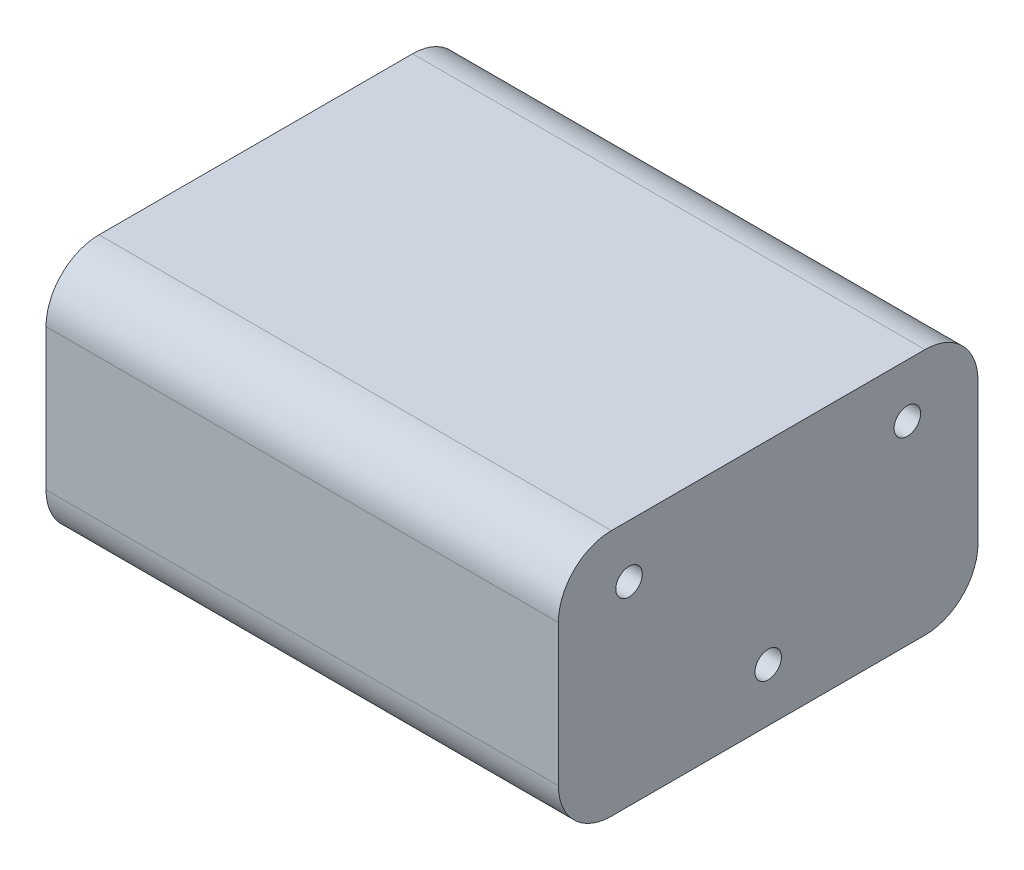
ISO-10303-21;
HEADER;
FILE_DESCRIPTION(('STEP AP214'),'2;1');
FILE_NAME('part.step','',(''),(''),'','','');
FILE_SCHEMA(('AUTOMOTIVE_DESIGN { 1 0 10303 214 1 1 1 1 }'));
ENDSEC;
DATA;
#1=APPLICATION_CONTEXT('core data for automotive mechanical design processes');
#2=APPLICATION_PROTOCOL_DEFINITION('international standard','automotive_design',2000,#1);
#3=PRODUCT_CONTEXT('',#1,'mechanical');
#4=PRODUCT('Part','Part','',(#3));
#5=PRODUCT_RELATED_PRODUCT_CATEGORY('part','',(#4));
#6=PRODUCT_DEFINITION_FORMATION('','',#4);
#7=PRODUCT_DEFINITION_CONTEXT('part definition',#1,'design');
#8=PRODUCT_DEFINITION('design','',#6,#7);
#9=PRODUCT_DEFINITION_SHAPE('','',#8);
#10=(LENGTH_UNIT() NAMED_UNIT(*) SI_UNIT(.MILLI.,.METRE.));
#11=(NAMED_UNIT(*) PLANE_ANGLE_UNIT() SI_UNIT($,.RADIAN.));
#12=(NAMED_UNIT(*) SI_UNIT($,.STERADIAN.) SOLID_ANGLE_UNIT());
#13=UNCERTAINTY_MEASURE_WITH_UNIT(LENGTH_MEASURE(1.E-05),#10,'distance_accuracy_value','');
#14=(GEOMETRIC_REPRESENTATION_CONTEXT(3) GLOBAL_UNCERTAINTY_ASSIGNED_CONTEXT((#13)) GLOBAL_UNIT_ASSIGNED_CONTEXT((#10,
#11,#12)) REPRESENTATION_CONTEXT('',''));
#15=CARTESIAN_POINT('',(0.,0.,0.));
#16=DIRECTION('',(0.,0.,1.));
#17=DIRECTION('',(1.,0.,0.));
#18=AXIS2_PLACEMENT_3D('',#15,#16,#17);
#19=CARTESIAN_POINT('',(29.,28.,23.75));
#20=DIRECTION('',(-1.,0.,0.));
#21=DIRECTION('',(0.,0.,1.));
#22=AXIS2_PLACEMENT_3D('',#19,#20,#21);
#23=PLANE('',#22);
#24=CARTESIAN_POINT('',(29.,6.,0.));
#25=DIRECTION('',(-1.,0.,0.));
#26=DIRECTION('',(0.,0.,1.));
#27=AXIS2_PLACEMENT_3D('',#24,#25,#26);
#28=CIRCLE('',#27,1.5);
#29=CARTESIAN_POINT('',(29.,6.,1.5));
#30=VERTEX_POINT('',#29);
#31=EDGE_CURVE('E511',#30,#30,#28,.T.);
#32=ORIENTED_EDGE('',*,*,#31,.T.);
#33=EDGE_LOOP('',(#32));
#34=FACE_BOUND('',#33,.T.);
#35=CARTESIAN_POINT('',(29.,22.,15.75));
#36=DIRECTION('',(-1.,0.,0.));
#37=DIRECTION('',(0.,0.,1.));
#38=AXIS2_PLACEMENT_3D('',#35,#36,#37);
#39=CIRCLE('',#38,1.5);
#40=CARTESIAN_POINT('',(29.,22.,17.25));
#41=VERTEX_POINT('',#40);
#42=EDGE_CURVE('E514',#41,#41,#39,.T.);
#43=ORIENTED_EDGE('',*,*,#42,.T.);
#44=EDGE_LOOP('',(#43));
#45=FACE_BOUND('',#44,.T.);
#46=CARTESIAN_POINT('',(29.,22.,-15.75));
#47=DIRECTION('',(-1.,0.,0.));
#48=DIRECTION('',(0.,0.,1.));
#49=AXIS2_PLACEMENT_3D('',#46,#47,#48);
#50=CIRCLE('',#49,1.5);
#51=CARTESIAN_POINT('',(29.,22.,-14.25));
#52=VERTEX_POINT('',#51);
#53=EDGE_CURVE('E488',#52,#52,#50,.T.);
#54=ORIENTED_EDGE('',*,*,#53,.T.);
#55=EDGE_LOOP('',(#54));
#56=FACE_BOUND('',#55,.T.);
#57=DIRECTION('',(0.,0.,-1.));
#58=VECTOR('',#57,1.);
#59=CARTESIAN_POINT('',(29.,0.,23.75));
#60=LINE('',#59,#58);
#61=CARTESIAN_POINT('',(29.,0.,17.75));
#62=VERTEX_POINT('',#61);
#63=CARTESIAN_POINT('',(29.,0.,-17.75));
#64=VERTEX_POINT('',#63);
#65=EDGE_CURVE('E204',#62,#64,#60,.T.);
#66=ORIENTED_EDGE('',*,*,#65,.T.);
#67=CARTESIAN_POINT('',(29.,6.,-17.75));
#68=DIRECTION('',(-1.,0.,0.));
#69=DIRECTION('',(0.,0.,1.));
#70=AXIS2_PLACEMENT_3D('',#67,#68,#69);
#71=CIRCLE('',#70,6.);
#72=CARTESIAN_POINT('',(29.,6.,-23.75));
#73=VERTEX_POINT('',#72);
#74=EDGE_CURVE('E176',#64,#73,#71,.F.);
#75=ORIENTED_EDGE('',*,*,#74,.T.);
#76=DIRECTION('',(0.,-1.,0.));
#77=VECTOR('',#76,1.);
#78=CARTESIAN_POINT('',(29.,28.,-23.75));
#79=LINE('',#78,#77);
#80=CARTESIAN_POINT('',(29.,22.,-23.75));
#81=VERTEX_POINT('',#80);
#82=EDGE_CURVE('E143',#81,#73,#79,.T.);
#83=ORIENTED_EDGE('',*,*,#82,.F.);
#84=CARTESIAN_POINT('',(29.,22.,-17.75));
#85=DIRECTION('',(-1.,0.,0.));
#86=DIRECTION('',(0.,0.,1.));
#87=AXIS2_PLACEMENT_3D('',#84,#85,#86);
#88=CIRCLE('',#87,6.);
#89=CARTESIAN_POINT('',(29.,28.,-17.75));
#90=VERTEX_POINT('',#89);
#91=EDGE_CURVE('E148',#81,#90,#88,.F.);
#92=ORIENTED_EDGE('',*,*,#91,.T.);
#93=DIRECTION('',(0.,0.,-1.));
#94=VECTOR('',#93,1.);
#95=CARTESIAN_POINT('',(29.,28.,23.75));
#96=LINE('',#95,#94);
#97=CARTESIAN_POINT('',(29.,28.,17.75));
#98=VERTEX_POINT('',#97);
#99=EDGE_CURVE('E191',#98,#90,#96,.T.);
#100=ORIENTED_EDGE('',*,*,#99,.F.);
#101=CARTESIAN_POINT('',(29.,22.,17.75));
#102=DIRECTION('',(-1.,0.,0.));
#103=DIRECTION('',(0.,0.,1.));
#104=AXIS2_PLACEMENT_3D('',#101,#102,#103);
#105=CIRCLE('',#104,6.);
#106=CARTESIAN_POINT('',(29.,22.,23.75));
#107=VERTEX_POINT('',#106);
#108=EDGE_CURVE('E77',#98,#107,#105,.F.);
#109=ORIENTED_EDGE('',*,*,#108,.T.);
#110=DIRECTION('',(0.,-1.,0.));
#111=VECTOR('',#110,1.);
#112=CARTESIAN_POINT('',(29.,28.,23.75));
#113=LINE('',#112,#111);
#114=CARTESIAN_POINT('',(29.,6.,23.75));
#115=VERTEX_POINT('',#114);
#116=EDGE_CURVE('E201',#107,#115,#113,.T.);
#117=ORIENTED_EDGE('',*,*,#116,.T.);
#118=CARTESIAN_POINT('',(29.,6.,17.75));
#119=DIRECTION('',(-1.,0.,0.));
#120=DIRECTION('',(0.,0.,1.));
#121=AXIS2_PLACEMENT_3D('',#118,#119,#120);
#122=CIRCLE('',#121,6.);
#123=EDGE_CURVE('E69',#115,#62,#122,.F.);
#124=ORIENTED_EDGE('',*,*,#123,.T.);
#125=EDGE_LOOP('',(#66,#75,#83,#92,#100,#109,#117,#124));
#126=FACE_BOUND('',#125,.T.);
#127=ADVANCED_FACE('F53',(#34,#45,#56,#126),#23,.F.);
#128=CARTESIAN_POINT('',(-29.,28.,-23.75));
#129=DIRECTION('',(0.,0.,1.));
#130=DIRECTION('',(1.,0.,0.));
#131=AXIS2_PLACEMENT_3D('',#128,#129,#130);
#132=PLANE('',#131);
#133=ORIENTED_EDGE('',*,*,#82,.T.);
#134=DIRECTION('',(-1.,0.,0.));
#135=VECTOR('',#134,1.);
#136=CARTESIAN_POINT('',(-29.,6.,-23.75));
#137=LINE('',#136,#135);
#138=CARTESIAN_POINT('',(-29.,6.,-23.75));
#139=VERTEX_POINT('',#138);
#140=EDGE_CURVE('E141',#73,#139,#137,.T.);
#141=ORIENTED_EDGE('',*,*,#140,.T.);
#142=DIRECTION('',(0.,-1.,0.));
#143=VECTOR('',#142,1.);
#144=CARTESIAN_POINT('',(-29.,28.,-23.75));
#145=LINE('',#144,#143);
#146=CARTESIAN_POINT('',(-29.,22.,-23.75));
#147=VERTEX_POINT('',#146);
#148=EDGE_CURVE('E124',#147,#139,#145,.T.);
#149=ORIENTED_EDGE('',*,*,#148,.F.);
#150=DIRECTION('',(-1.,0.,0.));
#151=VECTOR('',#150,1.);
#152=CARTESIAN_POINT('',(-29.,22.,-23.75));
#153=LINE('',#152,#151);
#154=EDGE_CURVE('E138',#147,#81,#153,.F.);
#155=ORIENTED_EDGE('',*,*,#154,.T.);
#156=EDGE_LOOP('',(#133,#141,#149,#155));
#157=FACE_BOUND('',#156,.T.);
#158=ADVANCED_FACE('F137',(#157),#132,.F.);
#159=CARTESIAN_POINT('',(-29.,28.,23.75));
#160=DIRECTION('',(1.,0.,0.));
#161=DIRECTION('',(0.,0.,-1.));
#162=AXIS2_PLACEMENT_3D('',#159,#160,#161);
#163=PLANE('',#162);
#164=CARTESIAN_POINT('',(-29.,22.,-0.107591006434725));
#165=DIRECTION('',(1.,0.,0.));
#166=DIRECTION('',(0.,0.,-1.));
#167=AXIS2_PLACEMENT_3D('',#164,#165,#166);
#168=CIRCLE('',#167,1.5);
#169=CARTESIAN_POINT('',(-29.,22.,-1.60759100643473));
#170=VERTEX_POINT('',#169);
#171=EDGE_CURVE('E482',#170,#170,#168,.T.);
#172=ORIENTED_EDGE('',*,*,#171,.T.);
#173=EDGE_LOOP('',(#172));
#174=FACE_BOUND('',#173,.T.);
#175=CARTESIAN_POINT('',(-29.,6.,15.75));
#176=DIRECTION('',(1.,0.,0.));
#177=DIRECTION('',(0.,0.,-1.));
#178=AXIS2_PLACEMENT_3D('',#175,#176,#177);
#179=CIRCLE('',#178,1.5);
#180=CARTESIAN_POINT('',(-29.,6.,14.25));
#181=VERTEX_POINT('',#180);
#182=EDGE_CURVE('E490',#181,#181,#179,.T.);
#183=ORIENTED_EDGE('',*,*,#182,.T.);
#184=EDGE_LOOP('',(#183));
#185=FACE_BOUND('',#184,.T.);
#186=CARTESIAN_POINT('',(-29.,6.,-15.75));
#187=DIRECTION('',(1.,0.,0.));
#188=DIRECTION('',(0.,0.,-1.));
#189=AXIS2_PLACEMENT_3D('',#186,#187,#188);
#190=CIRCLE('',#189,1.5);
#191=CARTESIAN_POINT('',(-29.,6.,-17.25));
#192=VERTEX_POINT('',#191);
#193=EDGE_CURVE('E500',#192,#192,#190,.T.);
#194=ORIENTED_EDGE('',*,*,#193,.T.);
#195=EDGE_LOOP('',(#194));
#196=FACE_BOUND('',#195,.T.);
#197=ORIENTED_EDGE('',*,*,#148,.T.);
#198=CARTESIAN_POINT('',(-29.,6.,-17.75));
#199=DIRECTION('',(1.,0.,0.));
#200=DIRECTION('',(0.,0.,-1.));
#201=AXIS2_PLACEMENT_3D('',#198,#199,#200);
#202=CIRCLE('',#201,6.);
#203=CARTESIAN_POINT('',(-29.,0.,-17.75));
#204=VERTEX_POINT('',#203);
#205=EDGE_CURVE('E161',#139,#204,#202,.F.);
#206=ORIENTED_EDGE('',*,*,#205,.T.);
#207=DIRECTION('',(0.,0.,1.));
#208=VECTOR('',#207,1.);
#209=CARTESIAN_POINT('',(-29.,0.,23.75));
#210=LINE('',#209,#208);
#211=CARTESIAN_POINT('',(-29.,0.,17.75));
#212=VERTEX_POINT('',#211);
#213=EDGE_CURVE('E196',#204,#212,#210,.T.);
#214=ORIENTED_EDGE('',*,*,#213,.T.);
#215=CARTESIAN_POINT('',(-29.,6.,17.75));
#216=DIRECTION('',(1.,0.,0.));
#217=DIRECTION('',(0.,0.,-1.));
#218=AXIS2_PLACEMENT_3D('',#215,#216,#217);
#219=CIRCLE('',#218,6.);
#220=CARTESIAN_POINT('',(-29.,6.,23.75));
#221=VERTEX_POINT('',#220);
#222=EDGE_CURVE('E131',#212,#221,#219,.F.);
#223=ORIENTED_EDGE('',*,*,#222,.T.);
#224=DIRECTION('',(0.,-1.,0.));
#225=VECTOR('',#224,1.);
#226=CARTESIAN_POINT('',(-29.,28.,23.75));
#227=LINE('',#226,#225);
#228=CARTESIAN_POINT('',(-29.,22.,23.75));
#229=VERTEX_POINT('',#228);
#230=EDGE_CURVE('E144',#229,#221,#227,.T.);
#231=ORIENTED_EDGE('',*,*,#230,.F.);
#232=CARTESIAN_POINT('',(-29.,22.,17.75));
#233=DIRECTION('',(1.,0.,0.));
#234=DIRECTION('',(0.,0.,-1.));
#235=AXIS2_PLACEMENT_3D('',#232,#233,#234);
#236=CIRCLE('',#235,6.);
#237=CARTESIAN_POINT('',(-29.,28.,17.75));
#238=VERTEX_POINT('',#237);
#239=EDGE_CURVE('E132',#229,#238,#236,.F.);
#240=ORIENTED_EDGE('',*,*,#239,.T.);
#241=DIRECTION('',(0.,0.,1.));
#242=VECTOR('',#241,1.);
#243=CARTESIAN_POINT('',(-29.,28.,23.75));
#244=LINE('',#243,#242);
#245=CARTESIAN_POINT('',(-29.,28.,-17.75));
#246=VERTEX_POINT('',#245);
#247=EDGE_CURVE('E126',#246,#238,#244,.T.);
#248=ORIENTED_EDGE('',*,*,#247,.F.);
#249=CARTESIAN_POINT('',(-29.,22.,-17.75));
#250=DIRECTION('',(1.,0.,0.));
#251=DIRECTION('',(0.,0.,-1.));
#252=AXIS2_PLACEMENT_3D('',#249,#250,#251);
#253=CIRCLE('',#252,6.);
#254=EDGE_CURVE('E121',#246,#147,#253,.F.);
#255=ORIENTED_EDGE('',*,*,#254,.T.);
#256=EDGE_LOOP('',(#197,#206,#214,#223,#231,#240,#248,#255));
#257=FACE_BOUND('',#256,.T.);
#258=ADVANCED_FACE('F123',(#174,#185,#196,#257),#163,.F.);
#259=CARTESIAN_POINT('',(-29.,28.,23.75));
#260=DIRECTION('',(0.,0.,-1.));
#261=DIRECTION('',(-1.,0.,0.));
#262=AXIS2_PLACEMENT_3D('',#259,#260,#261);
#263=PLANE('',#262);
#264=ORIENTED_EDGE('',*,*,#230,.T.);
#265=DIRECTION('',(1.,0.,0.));
#266=VECTOR('',#265,1.);
#267=CARTESIAN_POINT('',(29.,6.,23.75));
#268=LINE('',#267,#266);
#269=EDGE_CURVE('E182',#221,#115,#268,.T.);
#270=ORIENTED_EDGE('',*,*,#269,.T.);
#271=ORIENTED_EDGE('',*,*,#116,.F.);
#272=DIRECTION('',(1.,0.,0.));
#273=VECTOR('',#272,1.);
#274=CARTESIAN_POINT('',(-29.,22.,23.75));
#275=LINE('',#274,#273);
#276=EDGE_CURVE('E179',#107,#229,#275,.F.);
#277=ORIENTED_EDGE('',*,*,#276,.T.);
#278=EDGE_LOOP('',(#264,#270,#271,#277));
#279=FACE_BOUND('',#278,.T.);
#280=ADVANCED_FACE('F220',(#279),#263,.F.);
#281=CARTESIAN_POINT('',(0.,28.,0.));
#282=DIRECTION('',(0.,-1.,0.));
#283=DIRECTION('',(0.,0.,-1.));
#284=AXIS2_PLACEMENT_3D('',#281,#282,#283);
#285=PLANE('',#284);
#286=ORIENTED_EDGE('',*,*,#99,.T.);
#287=DIRECTION('',(-1.,0.,0.));
#288=VECTOR('',#287,1.);
#289=CARTESIAN_POINT('',(0.,28.,-17.75));
#290=LINE('',#289,#288);
#291=EDGE_CURVE('E13',#90,#246,#290,.T.);
#292=ORIENTED_EDGE('',*,*,#291,.T.);
#293=ORIENTED_EDGE('',*,*,#247,.T.);
#294=DIRECTION('',(1.,0.,0.));
#295=VECTOR('',#294,1.);
#296=CARTESIAN_POINT('',(0.,28.,17.75));
#297=LINE('',#296,#295);
#298=EDGE_CURVE('E62',#238,#98,#297,.T.);
#299=ORIENTED_EDGE('',*,*,#298,.T.);
#300=EDGE_LOOP('',(#286,#292,#293,#299));
#301=FACE_BOUND('',#300,.T.);
#302=ADVANCED_FACE('F190',(#301),#285,.F.);
#303=CARTESIAN_POINT('',(0.,0.,0.));
#304=DIRECTION('',(0.,-1.,0.));
#305=DIRECTION('',(0.,0.,-1.));
#306=AXIS2_PLACEMENT_3D('',#303,#304,#305);
#307=PLANE('',#306);
#308=ORIENTED_EDGE('',*,*,#213,.F.);
#309=DIRECTION('',(-1.,0.,0.));
#310=VECTOR('',#309,1.);
#311=CARTESIAN_POINT('',(29.,0.,-17.75));
#312=LINE('',#311,#310);
#313=EDGE_CURVE('E167',#204,#64,#312,.F.);
#314=ORIENTED_EDGE('',*,*,#313,.T.);
#315=ORIENTED_EDGE('',*,*,#65,.F.);
#316=DIRECTION('',(1.,0.,0.));
#317=VECTOR('',#316,1.);
#318=CARTESIAN_POINT('',(-29.,0.,17.75));
#319=LINE('',#318,#317);
#320=EDGE_CURVE('E164',#62,#212,#319,.F.);
#321=ORIENTED_EDGE('',*,*,#320,.T.);
#322=EDGE_LOOP('',(#308,#314,#315,#321));
#323=FACE_BOUND('',#322,.T.);
#324=ADVANCED_FACE('F227',(#323),#307,.T.);
#325=CARTESIAN_POINT('',(-29.,6.,-17.75));
#326=DIRECTION('',(1.,0.,0.));
#327=DIRECTION('',(0.,0.,-1.));
#328=AXIS2_PLACEMENT_3D('',#325,#326,#327);
#329=CYLINDRICAL_SURFACE('',#328,6.);
#330=ORIENTED_EDGE('',*,*,#74,.F.);
#331=ORIENTED_EDGE('',*,*,#313,.F.);
#332=ORIENTED_EDGE('',*,*,#205,.F.);
#333=ORIENTED_EDGE('',*,*,#140,.F.);
#334=EDGE_LOOP('',(#330,#331,#332,#333));
#335=FACE_BOUND('',#334,.T.);
#336=ADVANCED_FACE('F231',(#335),#329,.T.);
#337=CARTESIAN_POINT('',(-29.,6.,17.75));
#338=DIRECTION('',(-1.,0.,0.));
#339=DIRECTION('',(0.,0.,1.));
#340=AXIS2_PLACEMENT_3D('',#337,#338,#339);
#341=CYLINDRICAL_SURFACE('',#340,6.);
#342=ORIENTED_EDGE('',*,*,#222,.F.);
#343=ORIENTED_EDGE('',*,*,#320,.F.);
#344=ORIENTED_EDGE('',*,*,#123,.F.);
#345=ORIENTED_EDGE('',*,*,#269,.F.);
#346=EDGE_LOOP('',(#342,#343,#344,#345));
#347=FACE_BOUND('',#346,.T.);
#348=ADVANCED_FACE('F223',(#347),#341,.T.);
#349=CARTESIAN_POINT('',(0.,22.,-17.75));
#350=DIRECTION('',(-1.,0.,0.));
#351=DIRECTION('',(0.,0.,1.));
#352=AXIS2_PLACEMENT_3D('',#349,#350,#351);
#353=CYLINDRICAL_SURFACE('',#352,6.);
#354=ORIENTED_EDGE('',*,*,#91,.F.);
#355=ORIENTED_EDGE('',*,*,#154,.F.);
#356=ORIENTED_EDGE('',*,*,#254,.F.);
#357=ORIENTED_EDGE('',*,*,#291,.F.);
#358=EDGE_LOOP('',(#354,#355,#356,#357));
#359=FACE_BOUND('',#358,.T.);
#360=ADVANCED_FACE('F147',(#359),#353,.T.);
#361=CARTESIAN_POINT('',(0.,22.,17.75));
#362=DIRECTION('',(1.,0.,0.));
#363=DIRECTION('',(0.,0.,-1.));
#364=AXIS2_PLACEMENT_3D('',#361,#362,#363);
#365=CYLINDRICAL_SURFACE('',#364,6.);
#366=ORIENTED_EDGE('',*,*,#239,.F.);
#367=ORIENTED_EDGE('',*,*,#276,.F.);
#368=ORIENTED_EDGE('',*,*,#108,.F.);
#369=ORIENTED_EDGE('',*,*,#298,.F.);
#370=EDGE_LOOP('',(#366,#367,#368,#369));
#371=FACE_BOUND('',#370,.T.);
#372=ADVANCED_FACE('F55',(#371),#365,.T.);
#373=CARTESIAN_POINT('',(26.,22.,-15.75));
#374=DIRECTION('',(1.,0.,0.));
#375=DIRECTION('',(0.,0.,-1.));
#376=AXIS2_PLACEMENT_3D('',#373,#374,#375);
#377=CYLINDRICAL_SURFACE('',#376,1.5);
#378=CARTESIAN_POINT('',(26.,22.,-15.75));
#379=DIRECTION('',(-1.,0.,0.));
#380=DIRECTION('',(0.,0.,1.));
#381=AXIS2_PLACEMENT_3D('',#378,#379,#380);
#382=CIRCLE('',#381,1.5);
#383=CARTESIAN_POINT('',(26.,22.,-14.25));
#384=VERTEX_POINT('',#383);
#385=EDGE_CURVE('E207',#384,#384,#382,.T.);
#386=ORIENTED_EDGE('',*,*,#385,.T.);
#387=EDGE_LOOP('',(#386));
#388=FACE_BOUND('',#387,.T.);
#389=ORIENTED_EDGE('',*,*,#53,.F.);
#390=EDGE_LOOP('',(#389));
#391=FACE_BOUND('',#390,.T.);
#392=ADVANCED_FACE('F233',(#388,#391),#377,.F.);
#393=CARTESIAN_POINT('',(26.,22.,-15.75));
#394=DIRECTION('',(-1.,0.,0.));
#395=DIRECTION('',(0.,0.,1.));
#396=AXIS2_PLACEMENT_3D('',#393,#394,#395);
#397=PLANE('',#396);
#398=ORIENTED_EDGE('',*,*,#385,.F.);
#399=EDGE_LOOP('',(#398));
#400=FACE_BOUND('',#399,.T.);
#401=ADVANCED_FACE('F238',(#400),#397,.F.);
#402=CARTESIAN_POINT('',(26.,22.,15.75));
#403=DIRECTION('',(1.,0.,0.));
#404=DIRECTION('',(0.,0.,-1.));
#405=AXIS2_PLACEMENT_3D('',#402,#403,#404);
#406=CYLINDRICAL_SURFACE('',#405,1.5);
#407=CARTESIAN_POINT('',(26.,22.,15.75));
#408=DIRECTION('',(-1.,0.,0.));
#409=DIRECTION('',(0.,0.,1.));
#410=AXIS2_PLACEMENT_3D('',#407,#408,#409);
#411=CIRCLE('',#410,1.5);
#412=CARTESIAN_POINT('',(26.,22.,17.25));
#413=VERTEX_POINT('',#412);
#414=EDGE_CURVE('E518',#413,#413,#411,.T.);
#415=ORIENTED_EDGE('',*,*,#414,.T.);
#416=EDGE_LOOP('',(#415));
#417=FACE_BOUND('',#416,.T.);
#418=ORIENTED_EDGE('',*,*,#42,.F.);
#419=EDGE_LOOP('',(#418));
#420=FACE_BOUND('',#419,.T.);
#421=ADVANCED_FACE('F292',(#417,#420),#406,.F.);
#422=CARTESIAN_POINT('',(26.,22.,15.75));
#423=DIRECTION('',(-1.,0.,0.));
#424=DIRECTION('',(0.,0.,1.));
#425=AXIS2_PLACEMENT_3D('',#422,#423,#424);
#426=PLANE('',#425);
#427=ORIENTED_EDGE('',*,*,#414,.F.);
#428=EDGE_LOOP('',(#427));
#429=FACE_BOUND('',#428,.T.);
#430=ADVANCED_FACE('F303',(#429),#426,.F.);
#431=CARTESIAN_POINT('',(26.,6.,0.));
#432=DIRECTION('',(1.,0.,0.));
#433=DIRECTION('',(0.,0.,-1.));
#434=AXIS2_PLACEMENT_3D('',#431,#432,#433);
#435=CYLINDRICAL_SURFACE('',#434,1.5);
#436=CARTESIAN_POINT('',(26.,6.,0.));
#437=DIRECTION('',(-1.,0.,0.));
#438=DIRECTION('',(0.,0.,1.));
#439=AXIS2_PLACEMENT_3D('',#436,#437,#438);
#440=CIRCLE('',#439,1.5);
#441=CARTESIAN_POINT('',(26.,6.,1.5));
#442=VERTEX_POINT('',#441);
#443=EDGE_CURVE('E211',#442,#442,#440,.T.);
#444=ORIENTED_EDGE('',*,*,#443,.T.);
#445=EDGE_LOOP('',(#444));
#446=FACE_BOUND('',#445,.T.);
#447=ORIENTED_EDGE('',*,*,#31,.F.);
#448=EDGE_LOOP('',(#447));
#449=FACE_BOUND('',#448,.T.);
#450=ADVANCED_FACE('F314',(#446,#449),#435,.F.);
#451=CARTESIAN_POINT('',(26.,6.,0.));
#452=DIRECTION('',(-1.,0.,0.));
#453=DIRECTION('',(0.,0.,1.));
#454=AXIS2_PLACEMENT_3D('',#451,#452,#453);
#455=PLANE('',#454);
#456=ORIENTED_EDGE('',*,*,#443,.F.);
#457=EDGE_LOOP('',(#456));
#458=FACE_BOUND('',#457,.T.);
#459=ADVANCED_FACE('F325',(#458),#455,.F.);
#460=CARTESIAN_POINT('',(-26.,6.,-15.75));
#461=DIRECTION('',(-1.,0.,0.));
#462=DIRECTION('',(0.,0.,1.));
#463=AXIS2_PLACEMENT_3D('',#460,#461,#462);
#464=CYLINDRICAL_SURFACE('',#463,1.5);
#465=CARTESIAN_POINT('',(-26.,6.,-15.75));
#466=DIRECTION('',(1.,0.,0.));
#467=DIRECTION('',(0.,0.,-1.));
#468=AXIS2_PLACEMENT_3D('',#465,#466,#467);
#469=CIRCLE('',#468,1.5);
#470=CARTESIAN_POINT('',(-26.,6.,-17.25));
#471=VERTEX_POINT('',#470);
#472=EDGE_CURVE('E504',#471,#471,#469,.T.);
#473=ORIENTED_EDGE('',*,*,#472,.T.);
#474=EDGE_LOOP('',(#473));
#475=FACE_BOUND('',#474,.T.);
#476=ORIENTED_EDGE('',*,*,#193,.F.);
#477=EDGE_LOOP('',(#476));
#478=FACE_BOUND('',#477,.T.);
#479=ADVANCED_FACE('F336',(#475,#478),#464,.F.);
#480=CARTESIAN_POINT('',(-26.,6.,-15.75));
#481=DIRECTION('',(1.,0.,0.));
#482=DIRECTION('',(0.,0.,-1.));
#483=AXIS2_PLACEMENT_3D('',#480,#481,#482);
#484=PLANE('',#483);
#485=ORIENTED_EDGE('',*,*,#472,.F.);
#486=EDGE_LOOP('',(#485));
#487=FACE_BOUND('',#486,.T.);
#488=ADVANCED_FACE('F358',(#487),#484,.F.);
#489=CARTESIAN_POINT('',(-26.,6.,15.75));
#490=DIRECTION('',(-1.,0.,0.));
#491=DIRECTION('',(0.,0.,1.));
#492=AXIS2_PLACEMENT_3D('',#489,#490,#491);
#493=CYLINDRICAL_SURFACE('',#492,1.5);
#494=CARTESIAN_POINT('',(-26.,6.,15.75));
#495=DIRECTION('',(1.,0.,0.));
#496=DIRECTION('',(0.,0.,-1.));
#497=AXIS2_PLACEMENT_3D('',#494,#495,#496);
#498=CIRCLE('',#497,1.5);
#499=CARTESIAN_POINT('',(-26.,6.,14.25));
#500=VERTEX_POINT('',#499);
#501=EDGE_CURVE('E496',#500,#500,#498,.T.);
#502=ORIENTED_EDGE('',*,*,#501,.T.);
#503=EDGE_LOOP('',(#502));
#504=FACE_BOUND('',#503,.T.);
#505=ORIENTED_EDGE('',*,*,#182,.F.);
#506=EDGE_LOOP('',(#505));
#507=FACE_BOUND('',#506,.T.);
#508=ADVANCED_FACE('F369',(#504,#507),#493,.F.);
#509=CARTESIAN_POINT('',(-26.,6.,15.75));
#510=DIRECTION('',(1.,0.,0.));
#511=DIRECTION('',(0.,0.,-1.));
#512=AXIS2_PLACEMENT_3D('',#509,#510,#511);
#513=PLANE('',#512);
#514=ORIENTED_EDGE('',*,*,#501,.F.);
#515=EDGE_LOOP('',(#514));
#516=FACE_BOUND('',#515,.T.);
#517=ADVANCED_FACE('F380',(#516),#513,.F.);
#518=CARTESIAN_POINT('',(-26.,22.,-0.107591006434725));
#519=DIRECTION('',(-1.,0.,0.));
#520=DIRECTION('',(0.,0.,1.));
#521=AXIS2_PLACEMENT_3D('',#518,#519,#520);
#522=CYLINDRICAL_SURFACE('',#521,1.5);
#523=CARTESIAN_POINT('',(-26.,22.,-0.107591006434725));
#524=DIRECTION('',(1.,0.,0.));
#525=DIRECTION('',(0.,0.,-1.));
#526=AXIS2_PLACEMENT_3D('',#523,#524,#525);
#527=CIRCLE('',#526,1.5);
#528=CARTESIAN_POINT('',(-26.,22.,-1.60759100643473));
#529=VERTEX_POINT('',#528);
#530=EDGE_CURVE('E480',#529,#529,#527,.T.);
#531=ORIENTED_EDGE('',*,*,#530,.T.);
#532=EDGE_LOOP('',(#531));
#533=FACE_BOUND('',#532,.T.);
#534=ORIENTED_EDGE('',*,*,#171,.F.);
#535=EDGE_LOOP('',(#534));
#536=FACE_BOUND('',#535,.T.);
#537=ADVANCED_FACE('F391',(#533,#536),#522,.F.);
#538=CARTESIAN_POINT('',(-26.,22.,-0.107591006434725));
#539=DIRECTION('',(1.,0.,0.));
#540=DIRECTION('',(0.,0.,-1.));
#541=AXIS2_PLACEMENT_3D('',#538,#539,#540);
#542=PLANE('',#541);
#543=ORIENTED_EDGE('',*,*,#530,.F.);
#544=EDGE_LOOP('',(#543));
#545=FACE_BOUND('',#544,.T.);
#546=ADVANCED_FACE('F402',(#545),#542,.F.);
#547=CLOSED_SHELL('',(#127,#158,#258,#280,#302,#324,#336,#348,#360,#372,#392,#401,#421,#430,
#450,#459,#479,#488,#508,#517,#537,#546));
#548=MANIFOLD_SOLID_BREP('B2',#547);
#549=ADVANCED_BREP_SHAPE_REPRESENTATION('',(#18,#548),#14);
#550=SHAPE_DEFINITION_REPRESENTATION(#9,#549);
ENDSEC;
END-ISO-10303-21;
